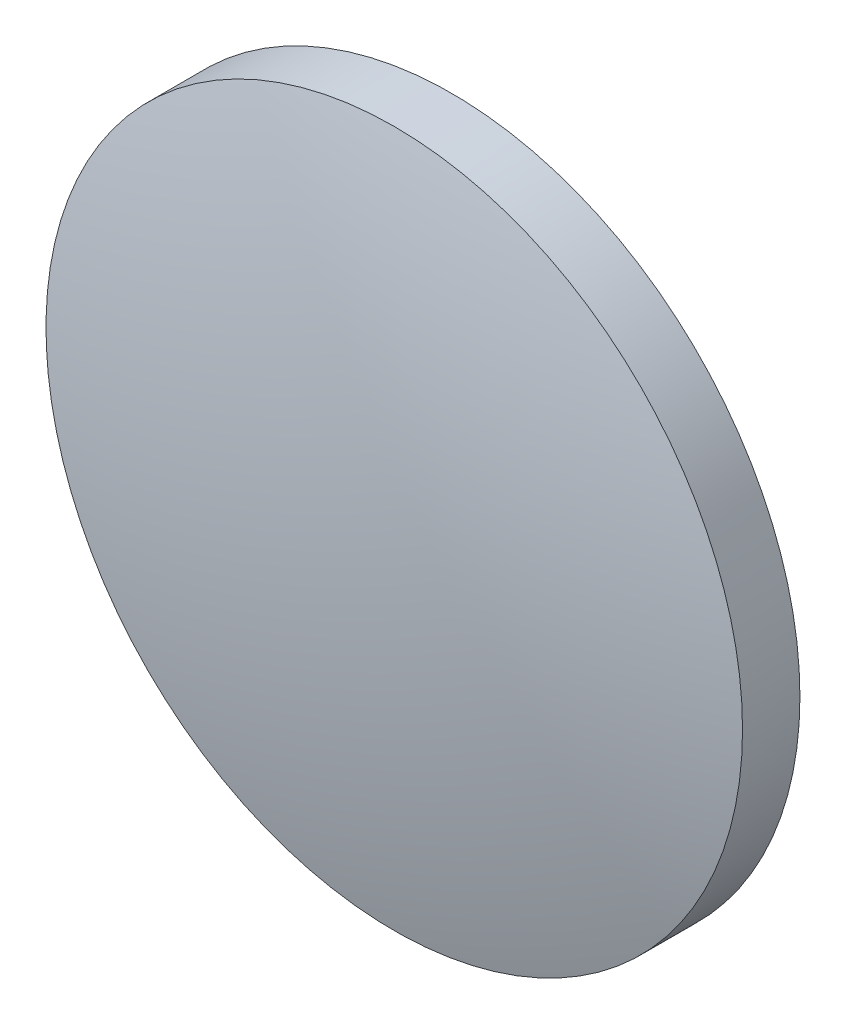
ISO-10303-21;
HEADER;
FILE_DESCRIPTION(('STEP AP214'),'2;1');
FILE_NAME('part.step','',(''),(''),'','','');
FILE_SCHEMA(('AUTOMOTIVE_DESIGN { 1 0 10303 214 1 1 1 1 }'));
ENDSEC;
DATA;
#1=APPLICATION_CONTEXT('core data for automotive mechanical design processes');
#2=APPLICATION_PROTOCOL_DEFINITION('international standard','automotive_design',2000,#1);
#3=PRODUCT_CONTEXT('',#1,'mechanical');
#4=PRODUCT('Part','Part','',(#3));
#5=PRODUCT_RELATED_PRODUCT_CATEGORY('part','',(#4));
#6=PRODUCT_DEFINITION_FORMATION('','',#4);
#7=PRODUCT_DEFINITION_CONTEXT('part definition',#1,'design');
#8=PRODUCT_DEFINITION('design','',#6,#7);
#9=PRODUCT_DEFINITION_SHAPE('','',#8);
#10=(LENGTH_UNIT() NAMED_UNIT(*) SI_UNIT(.MILLI.,.METRE.));
#11=(NAMED_UNIT(*) PLANE_ANGLE_UNIT() SI_UNIT($,.RADIAN.));
#12=(NAMED_UNIT(*) SI_UNIT($,.STERADIAN.) SOLID_ANGLE_UNIT());
#13=UNCERTAINTY_MEASURE_WITH_UNIT(LENGTH_MEASURE(1.E-05),#10,'distance_accuracy_value','');
#14=(GEOMETRIC_REPRESENTATION_CONTEXT(3) GLOBAL_UNCERTAINTY_ASSIGNED_CONTEXT((#13)) GLOBAL_UNIT_ASSIGNED_CONTEXT((#10,
#11,#12)) REPRESENTATION_CONTEXT('',''));
#15=CARTESIAN_POINT('',(0.,0.,0.));
#16=DIRECTION('',(0.,0.,1.));
#17=DIRECTION('',(1.,0.,0.));
#18=AXIS2_PLACEMENT_3D('',#15,#16,#17);
#19=CARTESIAN_POINT('',(0.,0.,-49.7));
#20=DIRECTION('',(0.,0.,1.));
#21=DIRECTION('',(0.,1.,0.));
#22=AXIS2_PLACEMENT_3D('',#19,#20,#21);
#23=SPHERICAL_SURFACE('',#22,51.5);
#24=CARTESIAN_POINT('',(0.,0.,0.259983987187183));
#25=DIRECTION('',(0.,0.,1.));
#26=DIRECTION('',(1.,0.,0.));
#27=AXIS2_PLACEMENT_3D('',#24,#25,#26);
#28=CIRCLE('',#27,12.5);
#29=CARTESIAN_POINT('',(12.5,0.,0.259983987187183));
#30=VERTEX_POINT('',#29);
#31=EDGE_CURVE('E8',#30,#30,#28,.T.);
#32=ORIENTED_EDGE('',*,*,#31,.T.);
#33=EDGE_LOOP('',(#32));
#34=FACE_BOUND('',#33,.T.);
#35=ADVANCED_FACE('F12',(#34),#23,.T.);
#36=CARTESIAN_POINT('',(0.,0.,4.30813204540037));
#37=DIRECTION('',(0.,0.,1.));
#38=DIRECTION('',(1.,0.,0.));
#39=AXIS2_PLACEMENT_3D('',#36,#37,#38);
#40=CYLINDRICAL_SURFACE('',#39,12.5);
#41=ORIENTED_EDGE('',*,*,#31,.F.);
#42=EDGE_LOOP('',(#41));
#43=FACE_BOUND('',#42,.T.);
#44=CARTESIAN_POINT('',(0.,0.,-1.8));
#45=DIRECTION('',(0.,0.,1.));
#46=DIRECTION('',(1.,0.,0.));
#47=AXIS2_PLACEMENT_3D('',#44,#45,#46);
#48=CIRCLE('',#47,12.5);
#49=CARTESIAN_POINT('',(12.5,0.,-1.8));
#50=VERTEX_POINT('',#49);
#51=EDGE_CURVE('E18',#50,#50,#48,.T.);
#52=ORIENTED_EDGE('',*,*,#51,.T.);
#53=EDGE_LOOP('',(#52));
#54=FACE_BOUND('',#53,.T.);
#55=ADVANCED_FACE('F24',(#43,#54),#40,.T.);
#56=CARTESIAN_POINT('',(0.,0.,-1.8));
#57=DIRECTION('',(0.,0.,1.));
#58=DIRECTION('',(1.,0.,0.));
#59=AXIS2_PLACEMENT_3D('',#56,#57,#58);
#60=PLANE('',#59);
#61=ORIENTED_EDGE('',*,*,#51,.F.);
#62=EDGE_LOOP('',(#61));
#63=FACE_BOUND('',#62,.T.);
#64=ADVANCED_FACE('F26',(#63),#60,.F.);
#65=CLOSED_SHELL('',(#35,#55,#64));
#66=MANIFOLD_SOLID_BREP('B1',#65);
#67=ADVANCED_BREP_SHAPE_REPRESENTATION('',(#18,#66),#14);
#68=SHAPE_DEFINITION_REPRESENTATION(#9,#67);
ENDSEC;
END-ISO-10303-21;
